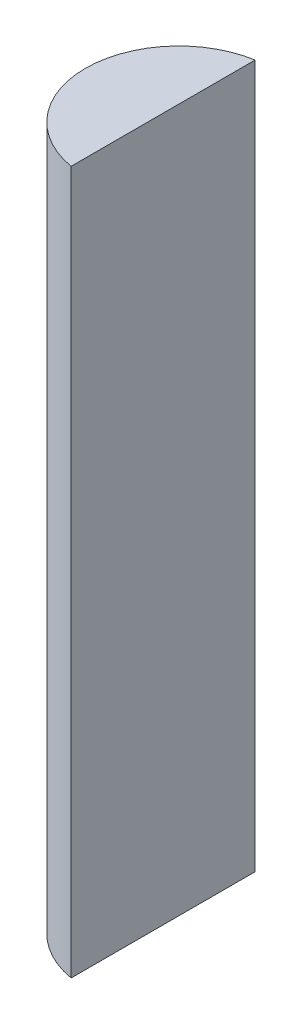
ISO-10303-21;
HEADER;
FILE_DESCRIPTION(('STEP AP214'),'2;1');
FILE_NAME('part.step','',(''),(''),'','','');
FILE_SCHEMA(('AUTOMOTIVE_DESIGN { 1 0 10303 214 1 1 1 1 }'));
ENDSEC;
DATA;
#1=APPLICATION_CONTEXT('core data for automotive mechanical design processes');
#2=APPLICATION_PROTOCOL_DEFINITION('international standard','automotive_design',2000,#1);
#3=PRODUCT_CONTEXT('',#1,'mechanical');
#4=PRODUCT('Part','Part','',(#3));
#5=PRODUCT_RELATED_PRODUCT_CATEGORY('part','',(#4));
#6=PRODUCT_DEFINITION_FORMATION('','',#4);
#7=PRODUCT_DEFINITION_CONTEXT('part definition',#1,'design');
#8=PRODUCT_DEFINITION('design','',#6,#7);
#9=PRODUCT_DEFINITION_SHAPE('','',#8);
#10=(LENGTH_UNIT() NAMED_UNIT(*) SI_UNIT(.MILLI.,.METRE.));
#11=(NAMED_UNIT(*) PLANE_ANGLE_UNIT() SI_UNIT($,.RADIAN.));
#12=(NAMED_UNIT(*) SI_UNIT($,.STERADIAN.) SOLID_ANGLE_UNIT());
#13=UNCERTAINTY_MEASURE_WITH_UNIT(LENGTH_MEASURE(1.E-05),#10,'distance_accuracy_value','');
#14=(GEOMETRIC_REPRESENTATION_CONTEXT(3) GLOBAL_UNCERTAINTY_ASSIGNED_CONTEXT((#13)) GLOBAL_UNIT_ASSIGNED_CONTEXT((#10,
#11,#12)) REPRESENTATION_CONTEXT('',''));
#15=CARTESIAN_POINT('',(0.,0.,0.));
#16=DIRECTION('',(0.,0.,1.));
#17=DIRECTION('',(1.,0.,0.));
#18=AXIS2_PLACEMENT_3D('',#15,#16,#17);
#19=CARTESIAN_POINT('',(0.,90.,0.));
#20=DIRECTION('',(0.,-1.,0.));
#21=DIRECTION('',(0.,0.,-1.));
#22=AXIS2_PLACEMENT_3D('',#19,#20,#21);
#23=CYLINDRICAL_SURFACE('',#22,11.95);
#24=CARTESIAN_POINT('',(0.,0.,0.));
#25=DIRECTION('',(0.,1.,0.));
#26=DIRECTION('',(0.,0.,1.));
#27=AXIS2_PLACEMENT_3D('',#24,#25,#26);
#28=CIRCLE('',#27,11.95);
#29=CARTESIAN_POINT('',(-2.,0.,-11.7814472795154));
#30=VERTEX_POINT('',#29);
#31=CARTESIAN_POINT('',(-2.,0.,11.7814472795154));
#32=VERTEX_POINT('',#31);
#33=EDGE_CURVE('E64',#30,#32,#28,.T.);
#34=ORIENTED_EDGE('',*,*,#33,.T.);
#35=DIRECTION('',(0.,-1.,0.));
#36=VECTOR('',#35,1.);
#37=CARTESIAN_POINT('',(-2.,90.,11.7814472795154));
#38=LINE('',#37,#36);
#39=CARTESIAN_POINT('',(-2.,90.,11.7814472795154));
#40=VERTEX_POINT('',#39);
#41=EDGE_CURVE('E11',#40,#32,#38,.T.);
#42=ORIENTED_EDGE('',*,*,#41,.F.);
#43=CARTESIAN_POINT('',(0.,90.,0.));
#44=DIRECTION('',(0.,1.,0.));
#45=DIRECTION('',(0.,0.,1.));
#46=AXIS2_PLACEMENT_3D('',#43,#44,#45);
#47=CIRCLE('',#46,11.95);
#48=CARTESIAN_POINT('',(-2.,90.,-11.7814472795154));
#49=VERTEX_POINT('',#48);
#50=EDGE_CURVE('E63',#49,#40,#47,.T.);
#51=ORIENTED_EDGE('',*,*,#50,.F.);
#52=DIRECTION('',(0.,-1.,0.));
#53=VECTOR('',#52,1.);
#54=CARTESIAN_POINT('',(-2.,90.,-11.7814472795154));
#55=LINE('',#54,#53);
#56=EDGE_CURVE('E41',#49,#30,#55,.T.);
#57=ORIENTED_EDGE('',*,*,#56,.T.);
#58=EDGE_LOOP('',(#34,#42,#51,#57));
#59=FACE_BOUND('',#58,.T.);
#60=ADVANCED_FACE('F33',(#59),#23,.T.);
#61=CARTESIAN_POINT('',(-2.,90.,11.7814472795154));
#62=DIRECTION('',(-1.,0.,0.));
#63=DIRECTION('',(0.,0.,1.));
#64=AXIS2_PLACEMENT_3D('',#61,#62,#63);
#65=PLANE('',#64);
#66=DIRECTION('',(0.,0.,-1.));
#67=VECTOR('',#66,1.);
#68=CARTESIAN_POINT('',(-2.,0.,11.7814472795154));
#69=LINE('',#68,#67);
#70=EDGE_CURVE('E56',#32,#30,#69,.T.);
#71=ORIENTED_EDGE('',*,*,#70,.T.);
#72=ORIENTED_EDGE('',*,*,#56,.F.);
#73=DIRECTION('',(0.,0.,-1.));
#74=VECTOR('',#73,1.);
#75=CARTESIAN_POINT('',(-2.,90.,11.7814472795154));
#76=LINE('',#75,#74);
#77=EDGE_CURVE('E48',#40,#49,#76,.T.);
#78=ORIENTED_EDGE('',*,*,#77,.F.);
#79=ORIENTED_EDGE('',*,*,#41,.T.);
#80=EDGE_LOOP('',(#71,#72,#78,#79));
#81=FACE_BOUND('',#80,.T.);
#82=ADVANCED_FACE('F59',(#81),#65,.F.);
#83=CARTESIAN_POINT('',(0.,90.,0.));
#84=DIRECTION('',(0.,1.,0.));
#85=DIRECTION('',(0.,0.,1.));
#86=AXIS2_PLACEMENT_3D('',#83,#84,#85);
#87=PLANE('',#86);
#88=ORIENTED_EDGE('',*,*,#50,.T.);
#89=ORIENTED_EDGE('',*,*,#77,.T.);
#90=EDGE_LOOP('',(#88,#89));
#91=FACE_BOUND('',#90,.T.);
#92=ADVANCED_FACE('F71',(#91),#87,.T.);
#93=CARTESIAN_POINT('',(0.,0.,0.));
#94=DIRECTION('',(0.,1.,0.));
#95=DIRECTION('',(0.,0.,1.));
#96=AXIS2_PLACEMENT_3D('',#93,#94,#95);
#97=PLANE('',#96);
#98=ORIENTED_EDGE('',*,*,#33,.F.);
#99=ORIENTED_EDGE('',*,*,#70,.F.);
#100=EDGE_LOOP('',(#98,#99));
#101=FACE_BOUND('',#100,.T.);
#102=ADVANCED_FACE('F67',(#101),#97,.F.);
#103=CLOSED_SHELL('',(#60,#82,#92,#102));
#104=MANIFOLD_SOLID_BREP('B2',#103);
#105=ADVANCED_BREP_SHAPE_REPRESENTATION('',(#18,#104),#14);
#106=SHAPE_DEFINITION_REPRESENTATION(#9,#105);
ENDSEC;
END-ISO-10303-21;
